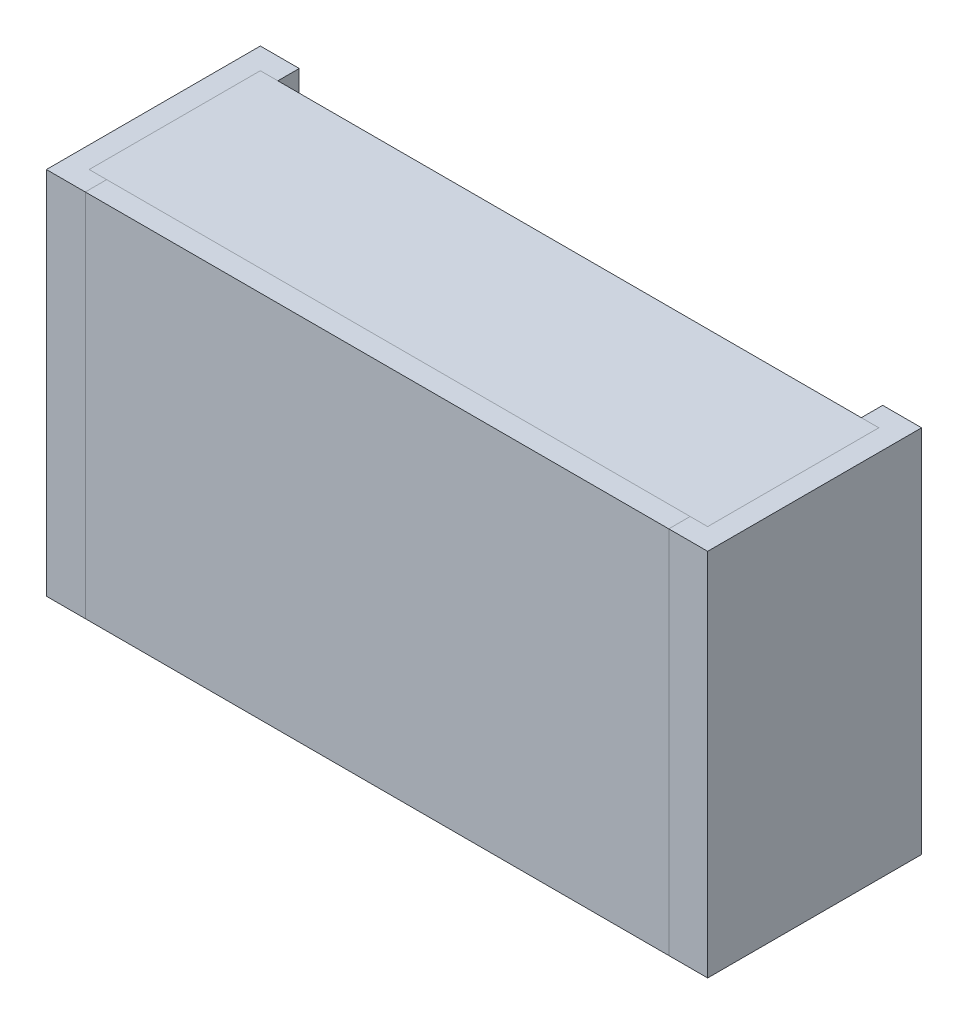
ISO-10303-21;
HEADER;
FILE_DESCRIPTION(('STEP AP214'),'2;1');
FILE_NAME('part.step','',(''),(''),'','','');
FILE_SCHEMA(('AUTOMOTIVE_DESIGN { 1 0 10303 214 1 1 1 1 }'));
ENDSEC;
DATA;
#1=APPLICATION_CONTEXT('core data for automotive mechanical design processes');
#2=APPLICATION_PROTOCOL_DEFINITION('international standard','automotive_design',2000,#1);
#3=PRODUCT_CONTEXT('',#1,'mechanical');
#4=PRODUCT('Part','Part','',(#3));
#5=PRODUCT_RELATED_PRODUCT_CATEGORY('part','',(#4));
#6=PRODUCT_DEFINITION_FORMATION('','',#4);
#7=PRODUCT_DEFINITION_CONTEXT('part definition',#1,'design');
#8=PRODUCT_DEFINITION('design','',#6,#7);
#9=PRODUCT_DEFINITION_SHAPE('','',#8);
#10=(LENGTH_UNIT() NAMED_UNIT(*) SI_UNIT(.MILLI.,.METRE.));
#11=(NAMED_UNIT(*) PLANE_ANGLE_UNIT() SI_UNIT($,.RADIAN.));
#12=(NAMED_UNIT(*) SI_UNIT($,.STERADIAN.) SOLID_ANGLE_UNIT());
#13=UNCERTAINTY_MEASURE_WITH_UNIT(LENGTH_MEASURE(1.E-05),#10,'distance_accuracy_value','');
#14=(GEOMETRIC_REPRESENTATION_CONTEXT(3) GLOBAL_UNCERTAINTY_ASSIGNED_CONTEXT((#13)) GLOBAL_UNIT_ASSIGNED_CONTEXT((#10,
#11,#12)) REPRESENTATION_CONTEXT('',''));
#15=CARTESIAN_POINT('',(0.,0.,0.));
#16=DIRECTION('',(0.,0.,1.));
#17=DIRECTION('',(1.,0.,0.));
#18=AXIS2_PLACEMENT_3D('',#15,#16,#17);
#19=CARTESIAN_POINT('',(-0.795,-0.47499746,0.055));
#20=DIRECTION('',(1.,0.,0.));
#21=DIRECTION('',(0.,0.,1.));
#22=AXIS2_PLACEMENT_3D('',#19,#20,#21);
#23=PLANE('',#22);
#24=DIRECTION('',(0.,1.,0.));
#25=VECTOR('',#24,1.);
#26=CARTESIAN_POINT('',(-0.795,-0.47499746,0.495));
#27=LINE('',#26,#25);
#28=CARTESIAN_POINT('',(-0.795,-0.47499746,0.495));
#29=VERTEX_POINT('',#28);
#30=CARTESIAN_POINT('',(-0.795,0.47500254,0.495));
#31=VERTEX_POINT('',#30);
#32=EDGE_CURVE('P0_E10',#29,#31,#27,.T.);
#33=ORIENTED_EDGE('',*,*,#32,.T.);
#34=DIRECTION('',(0.,0.,1.));
#35=VECTOR('',#34,1.);
#36=CARTESIAN_POINT('',(-0.795,0.47500254,0.055));
#37=LINE('',#36,#35);
#38=CARTESIAN_POINT('',(-0.795,0.47500254,0.055));
#39=VERTEX_POINT('',#38);
#40=EDGE_CURVE('P0_E23',#39,#31,#37,.T.);
#41=ORIENTED_EDGE('',*,*,#40,.F.);
#42=DIRECTION('',(0.,1.,0.));
#43=VECTOR('',#42,1.);
#44=CARTESIAN_POINT('',(-0.795,-0.47499746,0.055));
#45=LINE('',#44,#43);
#46=CARTESIAN_POINT('',(-0.795,-0.47499746,0.055));
#47=VERTEX_POINT('',#46);
#48=EDGE_CURVE('P0_E85',#47,#39,#45,.T.);
#49=ORIENTED_EDGE('',*,*,#48,.F.);
#50=DIRECTION('',(0.,0.,1.));
#51=VECTOR('',#50,1.);
#52=CARTESIAN_POINT('',(-0.795,-0.47499746,0.055));
#53=LINE('',#52,#51);
#54=EDGE_CURVE('P0_E33',#47,#29,#53,.T.);
#55=ORIENTED_EDGE('',*,*,#54,.T.);
#56=EDGE_LOOP('',(#33,#41,#49,#55));
#57=FACE_BOUND('',#56,.T.);
#58=ADVANCED_FACE('P0_F16',(#57),#23,.F.);
#59=CARTESIAN_POINT('',(0.795,-0.47499746,0.055));
#60=DIRECTION('',(1.,0.,0.));
#61=DIRECTION('',(0.,0.,1.));
#62=AXIS2_PLACEMENT_3D('',#59,#60,#61);
#63=PLANE('',#62);
#64=DIRECTION('',(0.,0.,1.));
#65=VECTOR('',#64,1.);
#66=CARTESIAN_POINT('',(0.795,-0.47499746,0.055));
#67=LINE('',#66,#65);
#68=CARTESIAN_POINT('',(0.795,-0.47499746,0.055));
#69=VERTEX_POINT('',#68);
#70=CARTESIAN_POINT('',(0.795,-0.47499746,0.495));
#71=VERTEX_POINT('',#70);
#72=EDGE_CURVE('P0_E82',#69,#71,#67,.T.);
#73=ORIENTED_EDGE('',*,*,#72,.F.);
#74=DIRECTION('',(0.,1.,0.));
#75=VECTOR('',#74,1.);
#76=CARTESIAN_POINT('',(0.795,-0.47499746,0.055));
#77=LINE('',#76,#75);
#78=CARTESIAN_POINT('',(0.795,0.47500254,0.055));
#79=VERTEX_POINT('',#78);
#80=EDGE_CURVE('P0_E58',#69,#79,#77,.T.);
#81=ORIENTED_EDGE('',*,*,#80,.T.);
#82=DIRECTION('',(0.,0.,1.));
#83=VECTOR('',#82,1.);
#84=CARTESIAN_POINT('',(0.795,0.47500254,0.055));
#85=LINE('',#84,#83);
#86=CARTESIAN_POINT('',(0.795,0.47500254,0.495));
#87=VERTEX_POINT('',#86);
#88=EDGE_CURVE('P0_E52',#79,#87,#85,.T.);
#89=ORIENTED_EDGE('',*,*,#88,.T.);
#90=DIRECTION('',(0.,1.,0.));
#91=VECTOR('',#90,1.);
#92=CARTESIAN_POINT('',(0.795,-0.47499746,0.495));
#93=LINE('',#92,#91);
#94=EDGE_CURVE('P0_E55',#71,#87,#93,.T.);
#95=ORIENTED_EDGE('',*,*,#94,.F.);
#96=EDGE_LOOP('',(#73,#81,#89,#95));
#97=FACE_BOUND('',#96,.T.);
#98=ADVANCED_FACE('P0_F54',(#97),#63,.T.);
#99=CARTESIAN_POINT('',(-0.795,-0.47499746,0.055));
#100=DIRECTION('',(0.,1.,0.));
#101=DIRECTION('',(0.,0.,1.));
#102=AXIS2_PLACEMENT_3D('',#99,#100,#101);
#103=PLANE('',#102);
#104=ORIENTED_EDGE('',*,*,#72,.T.);
#105=DIRECTION('',(1.,0.,0.));
#106=VECTOR('',#105,1.);
#107=CARTESIAN_POINT('',(-0.795,-0.47499746,0.495));
#108=LINE('',#107,#106);
#109=EDGE_CURVE('P0_E70',#29,#71,#108,.T.);
#110=ORIENTED_EDGE('',*,*,#109,.F.);
#111=ORIENTED_EDGE('',*,*,#54,.F.);
#112=DIRECTION('',(1.,0.,0.));
#113=VECTOR('',#112,1.);
#114=CARTESIAN_POINT('',(-0.795,-0.47499746,0.055));
#115=LINE('',#114,#113);
#116=EDGE_CURVE('P0_E75',#47,#69,#115,.T.);
#117=ORIENTED_EDGE('',*,*,#116,.T.);
#118=EDGE_LOOP('',(#104,#110,#111,#117));
#119=FACE_BOUND('',#118,.T.);
#120=ADVANCED_FACE('P0_F94',(#119),#103,.F.);
#121=CARTESIAN_POINT('',(-0.795,0.47500254,0.055));
#122=DIRECTION('',(0.,1.,0.));
#123=DIRECTION('',(0.,0.,1.));
#124=AXIS2_PLACEMENT_3D('',#121,#122,#123);
#125=PLANE('',#124);
#126=DIRECTION('',(1.,0.,0.));
#127=VECTOR('',#126,1.);
#128=CARTESIAN_POINT('',(-0.795,0.47500254,0.055));
#129=LINE('',#128,#127);
#130=EDGE_CURVE('P0_E73',#39,#79,#129,.T.);
#131=ORIENTED_EDGE('',*,*,#130,.F.);
#132=ORIENTED_EDGE('',*,*,#40,.T.);
#133=DIRECTION('',(1.,0.,0.));
#134=VECTOR('',#133,1.);
#135=CARTESIAN_POINT('',(-0.795,0.47500254,0.495));
#136=LINE('',#135,#134);
#137=EDGE_CURVE('P0_E68',#31,#87,#136,.T.);
#138=ORIENTED_EDGE('',*,*,#137,.T.);
#139=ORIENTED_EDGE('',*,*,#88,.F.);
#140=EDGE_LOOP('',(#131,#132,#138,#139));
#141=FACE_BOUND('',#140,.T.);
#142=ADVANCED_FACE('P0_F72',(#141),#125,.T.);
#143=CARTESIAN_POINT('',(-0.795,-0.47499746,0.055));
#144=DIRECTION('',(0.,0.,1.));
#145=DIRECTION('',(1.,0.,0.));
#146=AXIS2_PLACEMENT_3D('',#143,#144,#145);
#147=PLANE('',#146);
#148=ORIENTED_EDGE('',*,*,#130,.T.);
#149=ORIENTED_EDGE('',*,*,#80,.F.);
#150=ORIENTED_EDGE('',*,*,#116,.F.);
#151=ORIENTED_EDGE('',*,*,#48,.T.);
#152=EDGE_LOOP('',(#148,#149,#150,#151));
#153=FACE_BOUND('',#152,.T.);
#154=ADVANCED_FACE('P0_F88',(#153),#147,.F.);
#155=CARTESIAN_POINT('',(-0.795,-0.47499746,0.495));
#156=DIRECTION('',(0.,0.,1.));
#157=DIRECTION('',(1.,0.,0.));
#158=AXIS2_PLACEMENT_3D('',#155,#156,#157);
#159=PLANE('',#158);
#160=ORIENTED_EDGE('',*,*,#32,.F.);
#161=ORIENTED_EDGE('',*,*,#109,.T.);
#162=ORIENTED_EDGE('',*,*,#94,.T.);
#163=ORIENTED_EDGE('',*,*,#137,.F.);
#164=EDGE_LOOP('',(#160,#161,#162,#163));
#165=FACE_BOUND('',#164,.T.);
#166=ADVANCED_FACE('P0_F67',(#165),#159,.T.);
#167=CLOSED_SHELL('',(#58,#98,#120,#142,#154,#166));
#168=MANIFOLD_SOLID_BREP('P0_B1',#167);
#169=CARTESIAN_POINT('',(-0.85,-0.47499746,0.));
#170=DIRECTION('',(1.,0.,0.));
#171=DIRECTION('',(0.,0.,1.));
#172=AXIS2_PLACEMENT_3D('',#169,#170,#171);
#173=PLANE('',#172);
#174=DIRECTION('',(0.,1.,0.));
#175=VECTOR('',#174,1.);
#176=CARTESIAN_POINT('',(-0.85,-0.47499746,0.55));
#177=LINE('',#176,#175);
#178=CARTESIAN_POINT('',(-0.85,-0.47499746,0.55));
#179=VERTEX_POINT('',#178);
#180=CARTESIAN_POINT('',(-0.85,0.47500254,0.55));
#181=VERTEX_POINT('',#180);
#182=EDGE_CURVE('P1_E11',#179,#181,#177,.T.);
#183=ORIENTED_EDGE('',*,*,#182,.T.);
#184=DIRECTION('',(0.,0.,1.));
#185=VECTOR('',#184,1.);
#186=CARTESIAN_POINT('',(-0.85,0.47500254,0.));
#187=LINE('',#186,#185);
#188=CARTESIAN_POINT('',(-0.85,0.47500254,0.));
#189=VERTEX_POINT('',#188);
#190=EDGE_CURVE('P1_E24',#189,#181,#187,.T.);
#191=ORIENTED_EDGE('',*,*,#190,.F.);
#192=DIRECTION('',(0.,1.,0.));
#193=VECTOR('',#192,1.);
#194=CARTESIAN_POINT('',(-0.85,-0.47499746,0.));
#195=LINE('',#194,#193);
#196=CARTESIAN_POINT('',(-0.85,-0.47499746,0.));
#197=VERTEX_POINT('',#196);
#198=EDGE_CURVE('P1_E143',#197,#189,#195,.T.);
#199=ORIENTED_EDGE('',*,*,#198,.F.);
#200=DIRECTION('',(0.,0.,1.));
#201=VECTOR('',#200,1.);
#202=CARTESIAN_POINT('',(-0.85,-0.47499746,0.));
#203=LINE('',#202,#201);
#204=EDGE_CURVE('P1_E37',#197,#179,#203,.T.);
#205=ORIENTED_EDGE('',*,*,#204,.T.);
#206=EDGE_LOOP('',(#183,#191,#199,#205));
#207=FACE_BOUND('',#206,.T.);
#208=ADVANCED_FACE('P1_F17',(#207),#173,.F.);
#209=CARTESIAN_POINT('',(-0.85,-0.47499746,0.));
#210=DIRECTION('',(0.,1.,0.));
#211=DIRECTION('',(0.,0.,1.));
#212=AXIS2_PLACEMENT_3D('',#209,#210,#211);
#213=PLANE('',#212);
#214=DIRECTION('',(1.,0.,0.));
#215=VECTOR('',#214,1.);
#216=CARTESIAN_POINT('',(-0.795,-0.47499746,0.055));
#217=LINE('',#216,#215);
#218=CARTESIAN_POINT('',(-0.795,-0.47499746,0.055));
#219=VERTEX_POINT('',#218);
#220=CARTESIAN_POINT('',(-0.75,-0.47499746,0.055));
#221=VERTEX_POINT('',#220);
#222=EDGE_CURVE('P1_E140',#219,#221,#217,.T.);
#223=ORIENTED_EDGE('',*,*,#222,.F.);
#224=DIRECTION('',(0.,0.,1.));
#225=VECTOR('',#224,1.);
#226=CARTESIAN_POINT('',(-0.795,-0.47499746,0.055));
#227=LINE('',#226,#225);
#228=CARTESIAN_POINT('',(-0.795,-0.47499746,0.495));
#229=VERTEX_POINT('',#228);
#230=EDGE_CURVE('P1_E103',#219,#229,#227,.T.);
#231=ORIENTED_EDGE('',*,*,#230,.T.);
#232=DIRECTION('',(1.,0.,0.));
#233=VECTOR('',#232,1.);
#234=CARTESIAN_POINT('',(-0.795,-0.47499746,0.495));
#235=LINE('',#234,#233);
#236=CARTESIAN_POINT('',(-0.75,-0.47499746,0.495));
#237=VERTEX_POINT('',#236);
#238=EDGE_CURVE('P1_E136',#229,#237,#235,.T.);
#239=ORIENTED_EDGE('',*,*,#238,.T.);
#240=DIRECTION('',(0.,0.,1.));
#241=VECTOR('',#240,1.);
#242=CARTESIAN_POINT('',(-0.75,-0.47499746,0.));
#243=LINE('',#242,#241);
#244=CARTESIAN_POINT('',(-0.75,-0.47499746,0.55));
#245=VERTEX_POINT('',#244);
#246=EDGE_CURVE('P1_E133',#237,#245,#243,.T.);
#247=ORIENTED_EDGE('',*,*,#246,.T.);
#248=DIRECTION('',(1.,0.,0.));
#249=VECTOR('',#248,1.);
#250=CARTESIAN_POINT('',(-0.85,-0.47499746,0.55));
#251=LINE('',#250,#249);
#252=EDGE_CURVE('P1_E131',#179,#245,#251,.T.);
#253=ORIENTED_EDGE('',*,*,#252,.F.);
#254=ORIENTED_EDGE('',*,*,#204,.F.);
#255=DIRECTION('',(1.,0.,0.));
#256=VECTOR('',#255,1.);
#257=CARTESIAN_POINT('',(-0.85,-0.47499746,0.));
#258=LINE('',#257,#256);
#259=CARTESIAN_POINT('',(-0.75,-0.47499746,0.));
#260=VERTEX_POINT('',#259);
#261=EDGE_CURVE('P1_E128',#197,#260,#258,.T.);
#262=ORIENTED_EDGE('',*,*,#261,.T.);
#263=DIRECTION('',(0.,0.,1.));
#264=VECTOR('',#263,1.);
#265=CARTESIAN_POINT('',(-0.75,-0.47499746,0.));
#266=LINE('',#265,#264);
#267=EDGE_CURVE('P1_E126',#260,#221,#266,.T.);
#268=ORIENTED_EDGE('',*,*,#267,.T.);
#269=EDGE_LOOP('',(#223,#231,#239,#247,#253,#254,#262,#268));
#270=FACE_BOUND('',#269,.T.);
#271=ADVANCED_FACE('P1_F151',(#270),#213,.F.);
#272=CARTESIAN_POINT('',(-0.85,-0.47499746,0.55));
#273=DIRECTION('',(0.,0.,1.));
#274=DIRECTION('',(1.,0.,0.));
#275=AXIS2_PLACEMENT_3D('',#272,#273,#274);
#276=PLANE('',#275);
#277=ORIENTED_EDGE('',*,*,#182,.F.);
#278=ORIENTED_EDGE('',*,*,#252,.T.);
#279=DIRECTION('',(0.,1.,0.));
#280=VECTOR('',#279,1.);
#281=CARTESIAN_POINT('',(-0.75,-0.47499746,0.55));
#282=LINE('',#281,#280);
#283=CARTESIAN_POINT('',(-0.75,0.47500254,0.55));
#284=VERTEX_POINT('',#283);
#285=EDGE_CURVE('P1_E124',#245,#284,#282,.T.);
#286=ORIENTED_EDGE('',*,*,#285,.T.);
#287=DIRECTION('',(1.,0.,0.));
#288=VECTOR('',#287,1.);
#289=CARTESIAN_POINT('',(-0.85,0.47500254,0.55));
#290=LINE('',#289,#288);
#291=EDGE_CURVE('P1_E31',#181,#284,#290,.T.);
#292=ORIENTED_EDGE('',*,*,#291,.F.);
#293=EDGE_LOOP('',(#277,#278,#286,#292));
#294=FACE_BOUND('',#293,.T.);
#295=ADVANCED_FACE('P1_F148',(#294),#276,.T.);
#296=CARTESIAN_POINT('',(-0.85,0.47500254,0.));
#297=DIRECTION('',(0.,1.,0.));
#298=DIRECTION('',(0.,0.,1.));
#299=AXIS2_PLACEMENT_3D('',#296,#297,#298);
#300=PLANE('',#299);
#301=DIRECTION('',(0.,0.,1.));
#302=VECTOR('',#301,1.);
#303=CARTESIAN_POINT('',(-0.75,0.47500254,0.));
#304=LINE('',#303,#302);
#305=CARTESIAN_POINT('',(-0.75,0.47500254,0.));
#306=VERTEX_POINT('',#305);
#307=CARTESIAN_POINT('',(-0.75,0.47500254,0.055));
#308=VERTEX_POINT('',#307);
#309=EDGE_CURVE('P1_E121',#306,#308,#304,.T.);
#310=ORIENTED_EDGE('',*,*,#309,.F.);
#311=DIRECTION('',(1.,0.,0.));
#312=VECTOR('',#311,1.);
#313=CARTESIAN_POINT('',(-0.85,0.47500254,0.));
#314=LINE('',#313,#312);
#315=EDGE_CURVE('P1_E118',#189,#306,#314,.T.);
#316=ORIENTED_EDGE('',*,*,#315,.F.);
#317=ORIENTED_EDGE('',*,*,#190,.T.);
#318=ORIENTED_EDGE('',*,*,#291,.T.);
#319=DIRECTION('',(0.,0.,1.));
#320=VECTOR('',#319,1.);
#321=CARTESIAN_POINT('',(-0.75,0.47500254,0.));
#322=LINE('',#321,#320);
#323=CARTESIAN_POINT('',(-0.75,0.47500254,0.495));
#324=VERTEX_POINT('',#323);
#325=EDGE_CURVE('P1_E115',#324,#284,#322,.T.);
#326=ORIENTED_EDGE('',*,*,#325,.F.);
#327=DIRECTION('',(1.,0.,0.));
#328=VECTOR('',#327,1.);
#329=CARTESIAN_POINT('',(-0.795,0.47500254,0.495));
#330=LINE('',#329,#328);
#331=CARTESIAN_POINT('',(-0.795,0.47500254,0.495));
#332=VERTEX_POINT('',#331);
#333=EDGE_CURVE('P1_E97',#332,#324,#330,.T.);
#334=ORIENTED_EDGE('',*,*,#333,.F.);
#335=DIRECTION('',(0.,0.,1.));
#336=VECTOR('',#335,1.);
#337=CARTESIAN_POINT('',(-0.795,0.47500254,0.055));
#338=LINE('',#337,#336);
#339=CARTESIAN_POINT('',(-0.795,0.47500254,0.055));
#340=VERTEX_POINT('',#339);
#341=EDGE_CURVE('P1_E91',#340,#332,#338,.T.);
#342=ORIENTED_EDGE('',*,*,#341,.F.);
#343=DIRECTION('',(1.,0.,0.));
#344=VECTOR('',#343,1.);
#345=CARTESIAN_POINT('',(-0.795,0.47500254,0.055));
#346=LINE('',#345,#344);
#347=EDGE_CURVE('P1_E81',#340,#308,#346,.T.);
#348=ORIENTED_EDGE('',*,*,#347,.T.);
#349=EDGE_LOOP('',(#310,#316,#317,#318,#326,#334,#342,#348));
#350=FACE_BOUND('',#349,.T.);
#351=ADVANCED_FACE('P1_F95',(#350),#300,.T.);
#352=CARTESIAN_POINT('',(-0.85,-0.47499746,0.));
#353=DIRECTION('',(0.,0.,1.));
#354=DIRECTION('',(1.,0.,0.));
#355=AXIS2_PLACEMENT_3D('',#352,#353,#354);
#356=PLANE('',#355);
#357=ORIENTED_EDGE('',*,*,#315,.T.);
#358=DIRECTION('',(0.,1.,0.));
#359=VECTOR('',#358,1.);
#360=CARTESIAN_POINT('',(-0.75,-0.47499746,0.));
#361=LINE('',#360,#359);
#362=EDGE_CURVE('P1_E92',#260,#306,#361,.T.);
#363=ORIENTED_EDGE('',*,*,#362,.F.);
#364=ORIENTED_EDGE('',*,*,#261,.F.);
#365=ORIENTED_EDGE('',*,*,#198,.T.);
#366=EDGE_LOOP('',(#357,#363,#364,#365));
#367=FACE_BOUND('',#366,.T.);
#368=ADVANCED_FACE('P1_F179',(#367),#356,.F.);
#369=CARTESIAN_POINT('',(-0.75,-0.47499746,0.));
#370=DIRECTION('',(1.,0.,0.));
#371=DIRECTION('',(0.,0.,1.));
#372=AXIS2_PLACEMENT_3D('',#369,#370,#371);
#373=PLANE('',#372);
#374=ORIENTED_EDGE('',*,*,#267,.F.);
#375=ORIENTED_EDGE('',*,*,#362,.T.);
#376=ORIENTED_EDGE('',*,*,#309,.T.);
#377=DIRECTION('',(0.,-1.,0.));
#378=VECTOR('',#377,1.);
#379=CARTESIAN_POINT('',(-0.75,-0.47499746,0.055));
#380=LINE('',#379,#378);
#381=EDGE_CURVE('P1_E88',#308,#221,#380,.T.);
#382=ORIENTED_EDGE('',*,*,#381,.T.);
#383=EDGE_LOOP('',(#374,#375,#376,#382));
#384=FACE_BOUND('',#383,.T.);
#385=ADVANCED_FACE('P1_F182',(#384),#373,.T.);
#386=CARTESIAN_POINT('',(-0.795,-0.47499746,0.055));
#387=DIRECTION('',(0.,0.,1.));
#388=DIRECTION('',(1.,0.,0.));
#389=AXIS2_PLACEMENT_3D('',#386,#387,#388);
#390=PLANE('',#389);
#391=ORIENTED_EDGE('',*,*,#347,.F.);
#392=DIRECTION('',(0.,1.,0.));
#393=VECTOR('',#392,1.);
#394=CARTESIAN_POINT('',(-0.795,-0.47499746,0.055));
#395=LINE('',#394,#393);
#396=EDGE_CURVE('P1_E86',#219,#340,#395,.T.);
#397=ORIENTED_EDGE('',*,*,#396,.F.);
#398=ORIENTED_EDGE('',*,*,#222,.T.);
#399=ORIENTED_EDGE('',*,*,#381,.F.);
#400=EDGE_LOOP('',(#391,#397,#398,#399));
#401=FACE_BOUND('',#400,.T.);
#402=ADVANCED_FACE('P1_F83',(#401),#390,.T.);
#403=CARTESIAN_POINT('',(-0.795,-0.47499746,0.055));
#404=DIRECTION('',(1.,0.,0.));
#405=DIRECTION('',(0.,0.,1.));
#406=AXIS2_PLACEMENT_3D('',#403,#404,#405);
#407=PLANE('',#406);
#408=ORIENTED_EDGE('',*,*,#230,.F.);
#409=ORIENTED_EDGE('',*,*,#396,.T.);
#410=ORIENTED_EDGE('',*,*,#341,.T.);
#411=DIRECTION('',(0.,1.,0.));
#412=VECTOR('',#411,1.);
#413=CARTESIAN_POINT('',(-0.795,-0.47499746,0.495));
#414=LINE('',#413,#412);
#415=EDGE_CURVE('P1_E105',#229,#332,#414,.T.);
#416=ORIENTED_EDGE('',*,*,#415,.F.);
#417=EDGE_LOOP('',(#408,#409,#410,#416));
#418=FACE_BOUND('',#417,.T.);
#419=ADVANCED_FACE('P1_F102',(#418),#407,.T.);
#420=CARTESIAN_POINT('',(-0.795,-0.47499746,0.495));
#421=DIRECTION('',(0.,0.,1.));
#422=DIRECTION('',(1.,0.,0.));
#423=AXIS2_PLACEMENT_3D('',#420,#421,#422);
#424=PLANE('',#423);
#425=DIRECTION('',(0.,-1.,0.));
#426=VECTOR('',#425,1.);
#427=CARTESIAN_POINT('',(-0.75,-0.47499746,0.495));
#428=LINE('',#427,#426);
#429=EDGE_CURVE('P1_E108',#324,#237,#428,.T.);
#430=ORIENTED_EDGE('',*,*,#429,.T.);
#431=ORIENTED_EDGE('',*,*,#238,.F.);
#432=ORIENTED_EDGE('',*,*,#415,.T.);
#433=ORIENTED_EDGE('',*,*,#333,.T.);
#434=EDGE_LOOP('',(#430,#431,#432,#433));
#435=FACE_BOUND('',#434,.T.);
#436=ADVANCED_FACE('P1_F158',(#435),#424,.F.);
#437=CARTESIAN_POINT('',(-0.75,-0.47499746,0.));
#438=DIRECTION('',(1.,0.,0.));
#439=DIRECTION('',(0.,0.,1.));
#440=AXIS2_PLACEMENT_3D('',#437,#438,#439);
#441=PLANE('',#440);
#442=ORIENTED_EDGE('',*,*,#246,.F.);
#443=ORIENTED_EDGE('',*,*,#429,.F.);
#444=ORIENTED_EDGE('',*,*,#325,.T.);
#445=ORIENTED_EDGE('',*,*,#285,.F.);
#446=EDGE_LOOP('',(#442,#443,#444,#445));
#447=FACE_BOUND('',#446,.T.);
#448=ADVANCED_FACE('P1_F156',(#447),#441,.T.);
#449=CLOSED_SHELL('',(#208,#271,#295,#351,#368,#385,#402,#419,#436,#448));
#450=MANIFOLD_SOLID_BREP('P1_B1',#449);
#451=CARTESIAN_POINT('',(0.85,0.47500254,0.));
#452=DIRECTION('',(-1.,0.,0.));
#453=DIRECTION('',(0.,0.,1.));
#454=AXIS2_PLACEMENT_3D('',#451,#452,#453);
#455=PLANE('',#454);
#456=DIRECTION('',(0.,-1.,0.));
#457=VECTOR('',#456,1.);
#458=CARTESIAN_POINT('',(0.85,0.47500254,0.55));
#459=LINE('',#458,#457);
#460=CARTESIAN_POINT('',(0.85,0.47500254,0.55));
#461=VERTEX_POINT('',#460);
#462=CARTESIAN_POINT('',(0.85,-0.47499746,0.55));
#463=VERTEX_POINT('',#462);
#464=EDGE_CURVE('P2_E11',#461,#463,#459,.T.);
#465=ORIENTED_EDGE('',*,*,#464,.T.);
#466=DIRECTION('',(0.,0.,1.));
#467=VECTOR('',#466,1.);
#468=CARTESIAN_POINT('',(0.85,-0.47499746,0.));
#469=LINE('',#468,#467);
#470=CARTESIAN_POINT('',(0.85,-0.47499746,0.));
#471=VERTEX_POINT('',#470);
#472=EDGE_CURVE('P2_E24',#471,#463,#469,.T.);
#473=ORIENTED_EDGE('',*,*,#472,.F.);
#474=DIRECTION('',(0.,-1.,0.));
#475=VECTOR('',#474,1.);
#476=CARTESIAN_POINT('',(0.85,0.47500254,0.));
#477=LINE('',#476,#475);
#478=CARTESIAN_POINT('',(0.85,0.47500254,0.));
#479=VERTEX_POINT('',#478);
#480=EDGE_CURVE('P2_E137',#479,#471,#477,.T.);
#481=ORIENTED_EDGE('',*,*,#480,.F.);
#482=DIRECTION('',(0.,0.,1.));
#483=VECTOR('',#482,1.);
#484=CARTESIAN_POINT('',(0.85,0.47500254,0.));
#485=LINE('',#484,#483);
#486=EDGE_CURVE('P2_E37',#479,#461,#485,.T.);
#487=ORIENTED_EDGE('',*,*,#486,.T.);
#488=EDGE_LOOP('',(#465,#473,#481,#487));
#489=FACE_BOUND('',#488,.T.);
#490=ADVANCED_FACE('P2_F17',(#489),#455,.F.);
#491=CARTESIAN_POINT('',(0.85,0.47500254,0.));
#492=DIRECTION('',(0.,-1.,0.));
#493=DIRECTION('',(0.,0.,1.));
#494=AXIS2_PLACEMENT_3D('',#491,#492,#493);
#495=PLANE('',#494);
#496=DIRECTION('',(-1.,0.,0.));
#497=VECTOR('',#496,1.);
#498=CARTESIAN_POINT('',(0.795,0.47500254,0.055));
#499=LINE('',#498,#497);
#500=CARTESIAN_POINT('',(0.795,0.47500254,0.055));
#501=VERTEX_POINT('',#500);
#502=CARTESIAN_POINT('',(0.75,0.47500254,0.055));
#503=VERTEX_POINT('',#502);
#504=EDGE_CURVE('P2_E134',#501,#503,#499,.T.);
#505=ORIENTED_EDGE('',*,*,#504,.F.);
#506=DIRECTION('',(0.,0.,1.));
#507=VECTOR('',#506,1.);
#508=CARTESIAN_POINT('',(0.795,0.47500254,0.055));
#509=LINE('',#508,#507);
#510=CARTESIAN_POINT('',(0.795,0.47500254,0.495));
#511=VERTEX_POINT('',#510);
#512=EDGE_CURVE('P2_E88',#501,#511,#509,.T.);
#513=ORIENTED_EDGE('',*,*,#512,.T.);
#514=DIRECTION('',(-1.,0.,0.));
#515=VECTOR('',#514,1.);
#516=CARTESIAN_POINT('',(0.795,0.47500254,0.495));
#517=LINE('',#516,#515);
#518=CARTESIAN_POINT('',(0.75,0.47500254,0.495));
#519=VERTEX_POINT('',#518);
#520=EDGE_CURVE('P2_E130',#511,#519,#517,.T.);
#521=ORIENTED_EDGE('',*,*,#520,.T.);
#522=DIRECTION('',(0.,0.,1.));
#523=VECTOR('',#522,1.);
#524=CARTESIAN_POINT('',(0.75,0.47500254,0.));
#525=LINE('',#524,#523);
#526=CARTESIAN_POINT('',(0.75,0.47500254,0.55));
#527=VERTEX_POINT('',#526);
#528=EDGE_CURVE('P2_E127',#519,#527,#525,.T.);
#529=ORIENTED_EDGE('',*,*,#528,.T.);
#530=DIRECTION('',(-1.,0.,0.));
#531=VECTOR('',#530,1.);
#532=CARTESIAN_POINT('',(0.85,0.47500254,0.55));
#533=LINE('',#532,#531);
#534=EDGE_CURVE('P2_E125',#461,#527,#533,.T.);
#535=ORIENTED_EDGE('',*,*,#534,.F.);
#536=ORIENTED_EDGE('',*,*,#486,.F.);
#537=DIRECTION('',(-1.,0.,0.));
#538=VECTOR('',#537,1.);
#539=CARTESIAN_POINT('',(0.85,0.47500254,0.));
#540=LINE('',#539,#538);
#541=CARTESIAN_POINT('',(0.75,0.47500254,0.));
#542=VERTEX_POINT('',#541);
#543=EDGE_CURVE('P2_E123',#479,#542,#540,.T.);
#544=ORIENTED_EDGE('',*,*,#543,.T.);
#545=DIRECTION('',(0.,0.,1.));
#546=VECTOR('',#545,1.);
#547=CARTESIAN_POINT('',(0.75,0.47500254,0.));
#548=LINE('',#547,#546);
#549=EDGE_CURVE('P2_E121',#542,#503,#548,.T.);
#550=ORIENTED_EDGE('',*,*,#549,.T.);
#551=EDGE_LOOP('',(#505,#513,#521,#529,#535,#536,#544,#550));
#552=FACE_BOUND('',#551,.T.);
#553=ADVANCED_FACE('P2_F144',(#552),#495,.F.);
#554=CARTESIAN_POINT('',(0.85,0.47500254,0.55));
#555=DIRECTION('',(0.,0.,1.));
#556=DIRECTION('',(-1.,0.,0.));
#557=AXIS2_PLACEMENT_3D('',#554,#555,#556);
#558=PLANE('',#557);
#559=ORIENTED_EDGE('',*,*,#464,.F.);
#560=ORIENTED_EDGE('',*,*,#534,.T.);
#561=DIRECTION('',(0.,-1.,0.));
#562=VECTOR('',#561,1.);
#563=CARTESIAN_POINT('',(0.75,0.47500254,0.55));
#564=LINE('',#563,#562);
#565=CARTESIAN_POINT('',(0.75,-0.47499746,0.55));
#566=VERTEX_POINT('',#565);
#567=EDGE_CURVE('P2_E119',#527,#566,#564,.T.);
#568=ORIENTED_EDGE('',*,*,#567,.T.);
#569=DIRECTION('',(-1.,0.,0.));
#570=VECTOR('',#569,1.);
#571=CARTESIAN_POINT('',(0.85,-0.47499746,0.55));
#572=LINE('',#571,#570);
#573=EDGE_CURVE('P2_E31',#463,#566,#572,.T.);
#574=ORIENTED_EDGE('',*,*,#573,.F.);
#575=EDGE_LOOP('',(#559,#560,#568,#574));
#576=FACE_BOUND('',#575,.T.);
#577=ADVANCED_FACE('P2_F141',(#576),#558,.T.);
#578=CARTESIAN_POINT('',(0.85,-0.47499746,0.));
#579=DIRECTION('',(0.,-1.,0.));
#580=DIRECTION('',(0.,0.,1.));
#581=AXIS2_PLACEMENT_3D('',#578,#579,#580);
#582=PLANE('',#581);
#583=DIRECTION('',(0.,0.,1.));
#584=VECTOR('',#583,1.);
#585=CARTESIAN_POINT('',(0.75,-0.47499746,0.));
#586=LINE('',#585,#584);
#587=CARTESIAN_POINT('',(0.75,-0.47499746,0.));
#588=VERTEX_POINT('',#587);
#589=CARTESIAN_POINT('',(0.75,-0.47499746,0.055));
#590=VERTEX_POINT('',#589);
#591=EDGE_CURVE('P2_E116',#588,#590,#586,.T.);
#592=ORIENTED_EDGE('',*,*,#591,.F.);
#593=DIRECTION('',(-1.,0.,0.));
#594=VECTOR('',#593,1.);
#595=CARTESIAN_POINT('',(0.85,-0.47499746,0.));
#596=LINE('',#595,#594);
#597=EDGE_CURVE('P2_E113',#471,#588,#596,.T.);
#598=ORIENTED_EDGE('',*,*,#597,.F.);
#599=ORIENTED_EDGE('',*,*,#472,.T.);
#600=ORIENTED_EDGE('',*,*,#573,.T.);
#601=DIRECTION('',(0.,0.,1.));
#602=VECTOR('',#601,1.);
#603=CARTESIAN_POINT('',(0.75,-0.47499746,0.));
#604=LINE('',#603,#602);
#605=CARTESIAN_POINT('',(0.75,-0.47499746,0.495));
#606=VERTEX_POINT('',#605);
#607=EDGE_CURVE('P2_E107',#606,#566,#604,.T.);
#608=ORIENTED_EDGE('',*,*,#607,.F.);
#609=DIRECTION('',(-1.,0.,0.));
#610=VECTOR('',#609,1.);
#611=CARTESIAN_POINT('',(0.795,-0.47499746,0.495));
#612=LINE('',#611,#610);
#613=CARTESIAN_POINT('',(0.795,-0.47499746,0.495));
#614=VERTEX_POINT('',#613);
#615=EDGE_CURVE('P2_E105',#614,#606,#612,.T.);
#616=ORIENTED_EDGE('',*,*,#615,.F.);
#617=DIRECTION('',(0.,0.,1.));
#618=VECTOR('',#617,1.);
#619=CARTESIAN_POINT('',(0.795,-0.47499746,0.055));
#620=LINE('',#619,#618);
#621=CARTESIAN_POINT('',(0.795,-0.47499746,0.055));
#622=VERTEX_POINT('',#621);
#623=EDGE_CURVE('P2_E86',#622,#614,#620,.T.);
#624=ORIENTED_EDGE('',*,*,#623,.F.);
#625=DIRECTION('',(-1.,0.,0.));
#626=VECTOR('',#625,1.);
#627=CARTESIAN_POINT('',(0.795,-0.47499746,0.055));
#628=LINE('',#627,#626);
#629=EDGE_CURVE('P2_E96',#622,#590,#628,.T.);
#630=ORIENTED_EDGE('',*,*,#629,.T.);
#631=EDGE_LOOP('',(#592,#598,#599,#600,#608,#616,#624,#630));
#632=FACE_BOUND('',#631,.T.);
#633=ADVANCED_FACE('P2_F103',(#632),#582,.T.);
#634=CARTESIAN_POINT('',(0.85,0.47500254,0.));
#635=DIRECTION('',(0.,0.,1.));
#636=DIRECTION('',(-1.,0.,0.));
#637=AXIS2_PLACEMENT_3D('',#634,#635,#636);
#638=PLANE('',#637);
#639=ORIENTED_EDGE('',*,*,#597,.T.);
#640=DIRECTION('',(0.,-1.,0.));
#641=VECTOR('',#640,1.);
#642=CARTESIAN_POINT('',(0.75,0.47500254,0.));
#643=LINE('',#642,#641);
#644=EDGE_CURVE('P2_E101',#542,#588,#643,.T.);
#645=ORIENTED_EDGE('',*,*,#644,.F.);
#646=ORIENTED_EDGE('',*,*,#543,.F.);
#647=ORIENTED_EDGE('',*,*,#480,.T.);
#648=EDGE_LOOP('',(#639,#645,#646,#647));
#649=FACE_BOUND('',#648,.T.);
#650=ADVANCED_FACE('P2_F163',(#649),#638,.F.);
#651=CARTESIAN_POINT('',(0.75,0.47500254,0.));
#652=DIRECTION('',(-1.,0.,0.));
#653=DIRECTION('',(0.,0.,1.));
#654=AXIS2_PLACEMENT_3D('',#651,#652,#653);
#655=PLANE('',#654);
#656=ORIENTED_EDGE('',*,*,#549,.F.);
#657=ORIENTED_EDGE('',*,*,#644,.T.);
#658=ORIENTED_EDGE('',*,*,#591,.T.);
#659=DIRECTION('',(0.,1.,0.));
#660=VECTOR('',#659,1.);
#661=CARTESIAN_POINT('',(0.75,0.47500254,0.055));
#662=LINE('',#661,#660);
#663=EDGE_CURVE('P2_E92',#590,#503,#662,.T.);
#664=ORIENTED_EDGE('',*,*,#663,.T.);
#665=EDGE_LOOP('',(#656,#657,#658,#664));
#666=FACE_BOUND('',#665,.T.);
#667=ADVANCED_FACE('P2_F160',(#666),#655,.T.);
#668=CARTESIAN_POINT('',(0.795,0.47500254,0.055));
#669=DIRECTION('',(0.,0.,1.));
#670=DIRECTION('',(-1.,0.,0.));
#671=AXIS2_PLACEMENT_3D('',#668,#669,#670);
#672=PLANE('',#671);
#673=ORIENTED_EDGE('',*,*,#629,.F.);
#674=DIRECTION('',(0.,-1.,0.));
#675=VECTOR('',#674,1.);
#676=CARTESIAN_POINT('',(0.795,0.47500254,0.055));
#677=LINE('',#676,#675);
#678=EDGE_CURVE('P2_E81',#501,#622,#677,.T.);
#679=ORIENTED_EDGE('',*,*,#678,.F.);
#680=ORIENTED_EDGE('',*,*,#504,.T.);
#681=ORIENTED_EDGE('',*,*,#663,.F.);
#682=EDGE_LOOP('',(#673,#679,#680,#681));
#683=FACE_BOUND('',#682,.T.);
#684=ADVANCED_FACE('P2_F97',(#683),#672,.T.);
#685=CARTESIAN_POINT('',(0.795,0.47500254,0.055));
#686=DIRECTION('',(-1.,0.,0.));
#687=DIRECTION('',(0.,0.,1.));
#688=AXIS2_PLACEMENT_3D('',#685,#686,#687);
#689=PLANE('',#688);
#690=ORIENTED_EDGE('',*,*,#512,.F.);
#691=ORIENTED_EDGE('',*,*,#678,.T.);
#692=ORIENTED_EDGE('',*,*,#623,.T.);
#693=DIRECTION('',(0.,-1.,0.));
#694=VECTOR('',#693,1.);
#695=CARTESIAN_POINT('',(0.795,0.47500254,0.495));
#696=LINE('',#695,#694);
#697=EDGE_CURVE('P2_E93',#511,#614,#696,.T.);
#698=ORIENTED_EDGE('',*,*,#697,.F.);
#699=EDGE_LOOP('',(#690,#691,#692,#698));
#700=FACE_BOUND('',#699,.T.);
#701=ADVANCED_FACE('P2_F83',(#700),#689,.T.);
#702=CARTESIAN_POINT('',(0.795,0.47500254,0.495));
#703=DIRECTION('',(0.,0.,1.));
#704=DIRECTION('',(-1.,0.,0.));
#705=AXIS2_PLACEMENT_3D('',#702,#703,#704);
#706=PLANE('',#705);
#707=DIRECTION('',(0.,1.,0.));
#708=VECTOR('',#707,1.);
#709=CARTESIAN_POINT('',(0.75,0.47500254,0.495));
#710=LINE('',#709,#708);
#711=EDGE_CURVE('P2_E150',#606,#519,#710,.T.);
#712=ORIENTED_EDGE('',*,*,#711,.T.);
#713=ORIENTED_EDGE('',*,*,#520,.F.);
#714=ORIENTED_EDGE('',*,*,#697,.T.);
#715=ORIENTED_EDGE('',*,*,#615,.T.);
#716=EDGE_LOOP('',(#712,#713,#714,#715));
#717=FACE_BOUND('',#716,.T.);
#718=ADVANCED_FACE('P2_F152',(#717),#706,.F.);
#719=CARTESIAN_POINT('',(0.75,0.47500254,0.));
#720=DIRECTION('',(-1.,0.,0.));
#721=DIRECTION('',(0.,0.,1.));
#722=AXIS2_PLACEMENT_3D('',#719,#720,#721);
#723=PLANE('',#722);
#724=ORIENTED_EDGE('',*,*,#528,.F.);
#725=ORIENTED_EDGE('',*,*,#711,.F.);
#726=ORIENTED_EDGE('',*,*,#607,.T.);
#727=ORIENTED_EDGE('',*,*,#567,.F.);
#728=EDGE_LOOP('',(#724,#725,#726,#727));
#729=FACE_BOUND('',#728,.T.);
#730=ADVANCED_FACE('P2_F149',(#729),#723,.T.);
#731=CLOSED_SHELL('',(#490,#553,#577,#633,#650,#667,#684,#701,#718,#730));
#732=MANIFOLD_SOLID_BREP('P2_B1',#731);
#733=CARTESIAN_POINT('',(-0.75,-0.47499746,0.495));
#734=DIRECTION('',(1.,0.,0.));
#735=DIRECTION('',(0.,0.,1.));
#736=AXIS2_PLACEMENT_3D('',#733,#734,#735);
#737=PLANE('',#736);
#738=DIRECTION('',(0.,1.,0.));
#739=VECTOR('',#738,1.);
#740=CARTESIAN_POINT('',(-0.75,-0.47499746,0.55));
#741=LINE('',#740,#739);
#742=CARTESIAN_POINT('',(-0.75,-0.47499746,0.55));
#743=VERTEX_POINT('',#742);
#744=CARTESIAN_POINT('',(-0.75,0.47500254,0.55));
#745=VERTEX_POINT('',#744);
#746=EDGE_CURVE('P3_E10',#743,#745,#741,.T.);
#747=ORIENTED_EDGE('',*,*,#746,.T.);
#748=DIRECTION('',(0.,0.,1.));
#749=VECTOR('',#748,1.);
#750=CARTESIAN_POINT('',(-0.75,0.47500254,0.495));
#751=LINE('',#750,#749);
#752=CARTESIAN_POINT('',(-0.75,0.47500254,0.495));
#753=VERTEX_POINT('',#752);
#754=EDGE_CURVE('P3_E23',#753,#745,#751,.T.);
#755=ORIENTED_EDGE('',*,*,#754,.F.);
#756=DIRECTION('',(0.,1.,0.));
#757=VECTOR('',#756,1.);
#758=CARTESIAN_POINT('',(-0.75,-0.47499746,0.495));
#759=LINE('',#758,#757);
#760=CARTESIAN_POINT('',(-0.75,-0.47499746,0.495));
#761=VERTEX_POINT('',#760);
#762=EDGE_CURVE('P3_E85',#761,#753,#759,.T.);
#763=ORIENTED_EDGE('',*,*,#762,.F.);
#764=DIRECTION('',(0.,0.,1.));
#765=VECTOR('',#764,1.);
#766=CARTESIAN_POINT('',(-0.75,-0.47499746,0.495));
#767=LINE('',#766,#765);
#768=EDGE_CURVE('P3_E33',#761,#743,#767,.T.);
#769=ORIENTED_EDGE('',*,*,#768,.T.);
#770=EDGE_LOOP('',(#747,#755,#763,#769));
#771=FACE_BOUND('',#770,.T.);
#772=ADVANCED_FACE('P3_F16',(#771),#737,.F.);
#773=CARTESIAN_POINT('',(0.75,-0.47499746,0.495));
#774=DIRECTION('',(1.,0.,0.));
#775=DIRECTION('',(0.,0.,1.));
#776=AXIS2_PLACEMENT_3D('',#773,#774,#775);
#777=PLANE('',#776);
#778=DIRECTION('',(0.,0.,1.));
#779=VECTOR('',#778,1.);
#780=CARTESIAN_POINT('',(0.75,-0.47499746,0.495));
#781=LINE('',#780,#779);
#782=CARTESIAN_POINT('',(0.75,-0.47499746,0.495));
#783=VERTEX_POINT('',#782);
#784=CARTESIAN_POINT('',(0.75,-0.47499746,0.55));
#785=VERTEX_POINT('',#784);
#786=EDGE_CURVE('P3_E82',#783,#785,#781,.T.);
#787=ORIENTED_EDGE('',*,*,#786,.F.);
#788=DIRECTION('',(0.,1.,0.));
#789=VECTOR('',#788,1.);
#790=CARTESIAN_POINT('',(0.75,-0.47499746,0.495));
#791=LINE('',#790,#789);
#792=CARTESIAN_POINT('',(0.75,0.47500254,0.495));
#793=VERTEX_POINT('',#792);
#794=EDGE_CURVE('P3_E58',#783,#793,#791,.T.);
#795=ORIENTED_EDGE('',*,*,#794,.T.);
#796=DIRECTION('',(0.,0.,1.));
#797=VECTOR('',#796,1.);
#798=CARTESIAN_POINT('',(0.75,0.47500254,0.495));
#799=LINE('',#798,#797);
#800=CARTESIAN_POINT('',(0.75,0.47500254,0.55));
#801=VERTEX_POINT('',#800);
#802=EDGE_CURVE('P3_E53',#793,#801,#799,.T.);
#803=ORIENTED_EDGE('',*,*,#802,.T.);
#804=DIRECTION('',(0.,1.,0.));
#805=VECTOR('',#804,1.);
#806=CARTESIAN_POINT('',(0.75,-0.47499746,0.55));
#807=LINE('',#806,#805);
#808=EDGE_CURVE('P3_E56',#785,#801,#807,.T.);
#809=ORIENTED_EDGE('',*,*,#808,.F.);
#810=EDGE_LOOP('',(#787,#795,#803,#809));
#811=FACE_BOUND('',#810,.T.);
#812=ADVANCED_FACE('P3_F55',(#811),#777,.T.);
#813=CARTESIAN_POINT('',(-0.75,-0.47499746,0.495));
#814=DIRECTION('',(0.,1.,0.));
#815=DIRECTION('',(0.,0.,1.));
#816=AXIS2_PLACEMENT_3D('',#813,#814,#815);
#817=PLANE('',#816);
#818=ORIENTED_EDGE('',*,*,#786,.T.);
#819=DIRECTION('',(1.,0.,0.));
#820=VECTOR('',#819,1.);
#821=CARTESIAN_POINT('',(-0.75,-0.47499746,0.55));
#822=LINE('',#821,#820);
#823=EDGE_CURVE('P3_E70',#743,#785,#822,.T.);
#824=ORIENTED_EDGE('',*,*,#823,.F.);
#825=ORIENTED_EDGE('',*,*,#768,.F.);
#826=DIRECTION('',(1.,0.,0.));
#827=VECTOR('',#826,1.);
#828=CARTESIAN_POINT('',(-0.75,-0.47499746,0.495));
#829=LINE('',#828,#827);
#830=EDGE_CURVE('P3_E75',#761,#783,#829,.T.);
#831=ORIENTED_EDGE('',*,*,#830,.T.);
#832=EDGE_LOOP('',(#818,#824,#825,#831));
#833=FACE_BOUND('',#832,.T.);
#834=ADVANCED_FACE('P3_F94',(#833),#817,.F.);
#835=CARTESIAN_POINT('',(-0.75,0.47500254,0.495));
#836=DIRECTION('',(0.,1.,0.));
#837=DIRECTION('',(0.,0.,1.));
#838=AXIS2_PLACEMENT_3D('',#835,#836,#837);
#839=PLANE('',#838);
#840=DIRECTION('',(1.,0.,0.));
#841=VECTOR('',#840,1.);
#842=CARTESIAN_POINT('',(-0.75,0.47500254,0.495));
#843=LINE('',#842,#841);
#844=EDGE_CURVE('P3_E73',#753,#793,#843,.T.);
#845=ORIENTED_EDGE('',*,*,#844,.F.);
#846=ORIENTED_EDGE('',*,*,#754,.T.);
#847=DIRECTION('',(1.,0.,0.));
#848=VECTOR('',#847,1.);
#849=CARTESIAN_POINT('',(-0.75,0.47500254,0.55));
#850=LINE('',#849,#848);
#851=EDGE_CURVE('P3_E68',#745,#801,#850,.T.);
#852=ORIENTED_EDGE('',*,*,#851,.T.);
#853=ORIENTED_EDGE('',*,*,#802,.F.);
#854=EDGE_LOOP('',(#845,#846,#852,#853));
#855=FACE_BOUND('',#854,.T.);
#856=ADVANCED_FACE('P3_F72',(#855),#839,.T.);
#857=CARTESIAN_POINT('',(-0.75,-0.47499746,0.495));
#858=DIRECTION('',(0.,0.,1.));
#859=DIRECTION('',(1.,0.,0.));
#860=AXIS2_PLACEMENT_3D('',#857,#858,#859);
#861=PLANE('',#860);
#862=ORIENTED_EDGE('',*,*,#844,.T.);
#863=ORIENTED_EDGE('',*,*,#794,.F.);
#864=ORIENTED_EDGE('',*,*,#830,.F.);
#865=ORIENTED_EDGE('',*,*,#762,.T.);
#866=EDGE_LOOP('',(#862,#863,#864,#865));
#867=FACE_BOUND('',#866,.T.);
#868=ADVANCED_FACE('P3_F88',(#867),#861,.F.);
#869=CARTESIAN_POINT('',(-0.75,-0.47499746,0.55));
#870=DIRECTION('',(0.,0.,1.));
#871=DIRECTION('',(1.,0.,0.));
#872=AXIS2_PLACEMENT_3D('',#869,#870,#871);
#873=PLANE('',#872);
#874=ORIENTED_EDGE('',*,*,#746,.F.);
#875=ORIENTED_EDGE('',*,*,#823,.T.);
#876=ORIENTED_EDGE('',*,*,#808,.T.);
#877=ORIENTED_EDGE('',*,*,#851,.F.);
#878=EDGE_LOOP('',(#874,#875,#876,#877));
#879=FACE_BOUND('',#878,.T.);
#880=ADVANCED_FACE('P3_F67',(#879),#873,.T.);
#881=CLOSED_SHELL('',(#772,#812,#834,#856,#868,#880));
#882=MANIFOLD_SOLID_BREP('P3_B1',#881);
#883=ADVANCED_BREP_SHAPE_REPRESENTATION('',(#18,#168,#450,#732,#882),#14);
#884=SHAPE_DEFINITION_REPRESENTATION(#9,#883);
ENDSEC;
END-ISO-10303-21;
